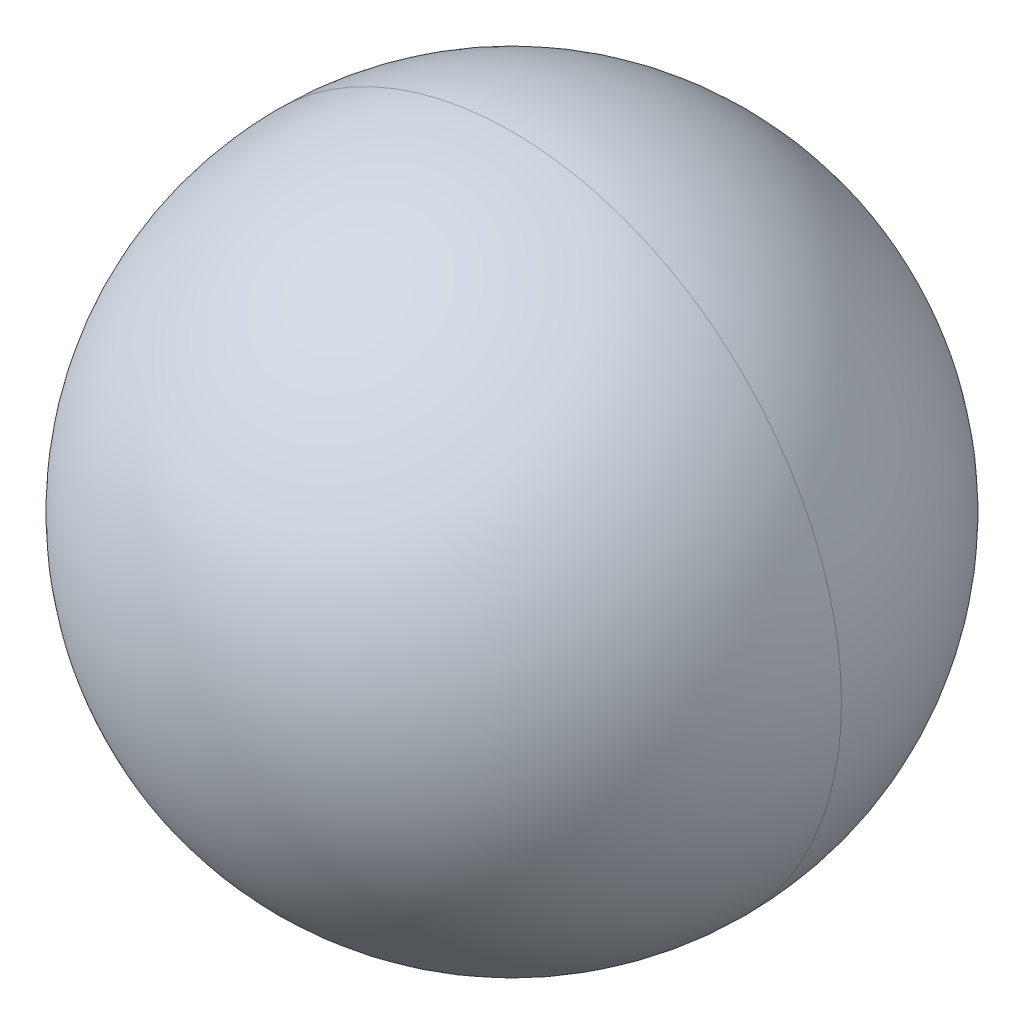
ISO-10303-21;
HEADER;
FILE_DESCRIPTION(('STEP AP214'),'2;1');
FILE_NAME('part.step','',(''),(''),'','','');
FILE_SCHEMA(('AUTOMOTIVE_DESIGN { 1 0 10303 214 1 1 1 1 }'));
ENDSEC;
DATA;
#1=APPLICATION_CONTEXT('core data for automotive mechanical design processes');
#2=APPLICATION_PROTOCOL_DEFINITION('international standard','automotive_design',2000,#1);
#3=PRODUCT_CONTEXT('',#1,'mechanical');
#4=PRODUCT('Part','Part','',(#3));
#5=PRODUCT_RELATED_PRODUCT_CATEGORY('part','',(#4));
#6=PRODUCT_DEFINITION_FORMATION('','',#4);
#7=PRODUCT_DEFINITION_CONTEXT('part definition',#1,'design');
#8=PRODUCT_DEFINITION('design','',#6,#7);
#9=PRODUCT_DEFINITION_SHAPE('','',#8);
#10=(LENGTH_UNIT() NAMED_UNIT(*) SI_UNIT(.MILLI.,.METRE.));
#11=(NAMED_UNIT(*) PLANE_ANGLE_UNIT() SI_UNIT($,.RADIAN.));
#12=(NAMED_UNIT(*) SI_UNIT($,.STERADIAN.) SOLID_ANGLE_UNIT());
#13=UNCERTAINTY_MEASURE_WITH_UNIT(LENGTH_MEASURE(1.E-05),#10,'distance_accuracy_value','');
#14=(GEOMETRIC_REPRESENTATION_CONTEXT(3) GLOBAL_UNCERTAINTY_ASSIGNED_CONTEXT((#13)) GLOBAL_UNIT_ASSIGNED_CONTEXT((#10,
#11,#12)) REPRESENTATION_CONTEXT('',''));
#15=CARTESIAN_POINT('',(0.,0.,0.));
#16=DIRECTION('',(0.,0.,1.));
#17=DIRECTION('',(1.,0.,0.));
#18=AXIS2_PLACEMENT_3D('',#15,#16,#17);
#19=CARTESIAN_POINT('',(-0.2,0.2,0.135));
#20=DIRECTION('',(0.,0.,-1.));
#21=DIRECTION('',(1.,0.,0.));
#22=AXIS2_PLACEMENT_3D('',#19,#20,#21);
#23=SPHERICAL_SURFACE('',#22,0.135);
#24=CARTESIAN_POINT('',(-0.2,0.2,0.135));
#25=DIRECTION('',(0.,0.,1.));
#26=DIRECTION('',(1.,0.,0.));
#27=AXIS2_PLACEMENT_3D('',#24,#25,#26);
#28=CIRCLE('',#27,0.135);
#29=CARTESIAN_POINT('',(-0.065,0.2,0.135));
#30=VERTEX_POINT('',#29);
#31=CARTESIAN_POINT('',(-0.2,0.335,0.135));
#32=VERTEX_POINT('',#31);
#33=EDGE_CURVE('E11',#30,#32,#28,.T.);
#34=ORIENTED_EDGE('',*,*,#33,.F.);
#35=CARTESIAN_POINT('',(-0.065,0.2,0.135));
#36=CARTESIAN_POINT('',(-0.0649999999999998,0.2,0.0925884991765377));
#37=CARTESIAN_POINT('',(-0.0816070255461748,0.2,0.0501374281460087));
#38=CARTESIAN_POINT('',(-0.115137428146008,0.2,0.0166070255461743));
#39=CARTESIAN_POINT('',(-0.157588499176538,0.2,0.));
#40=CARTESIAN_POINT('',(-0.2,0.2,0.));
#41=B_SPLINE_CURVE_WITH_KNOTS('',5,(#35,#36,#37,#38,#39,#40),.UNSPECIFIED.,.F.,.F.,(6,6),(0.,
1.5707963267949),.UNSPECIFIED.);
#42=CARTESIAN_POINT('',(-0.2,0.2,0.));
#43=VERTEX_POINT('',#42);
#44=EDGE_CURVE('E24',#30,#43,#41,.T.);
#45=ORIENTED_EDGE('',*,*,#44,.T.);
#46=ORIENTED_EDGE('',*,*,#44,.F.);
#47=CARTESIAN_POINT('',(-0.2,0.065,0.135));
#48=VERTEX_POINT('',#47);
#49=EDGE_CURVE('E25',#48,#30,#28,.T.);
#50=ORIENTED_EDGE('',*,*,#49,.F.);
#51=CARTESIAN_POINT('',(-0.2,0.2,0.135));
#52=DIRECTION('',(0.,0.,-1.));
#53=DIRECTION('',(-1.,0.,0.));
#54=AXIS2_PLACEMENT_3D('',#51,#52,#53);
#55=CIRCLE('',#54,0.135);
#56=EDGE_CURVE('E46',#48,#32,#55,.T.);
#57=ORIENTED_EDGE('',*,*,#56,.T.);
#58=EDGE_LOOP('',(#34,#45,#46,#50,#57));
#59=FACE_BOUND('',#58,.T.);
#60=ADVANCED_FACE('F17',(#59),#23,.T.);
#61=CARTESIAN_POINT('',(-0.2,0.2,0.135));
#62=DIRECTION('',(0.,0.,-1.));
#63=DIRECTION('',(1.,0.,0.));
#64=AXIS2_PLACEMENT_3D('',#61,#62,#63);
#65=SPHERICAL_SURFACE('',#64,0.135);
#66=ORIENTED_EDGE('',*,*,#56,.F.);
#67=ORIENTED_EDGE('',*,*,#49,.T.);
#68=CARTESIAN_POINT('',(-0.2,0.2,0.27));
#69=CARTESIAN_POINT('',(-0.157588499176538,0.2,0.270000000000001));
#70=CARTESIAN_POINT('',(-0.115137428146008,0.2,0.253392974453824));
#71=CARTESIAN_POINT('',(-0.0816070255461746,0.200000000000001,0.219862571853992));
#72=CARTESIAN_POINT('',(-0.0649999999999999,0.2,0.177411500823462));
#73=CARTESIAN_POINT('',(-0.065,0.2,0.135));
#74=B_SPLINE_CURVE_WITH_KNOTS('',5,(#68,#69,#70,#71,#72,#73),.UNSPECIFIED.,.F.,.F.,(6,6),
(-1.5707963267949,0.),.UNSPECIFIED.);
#75=CARTESIAN_POINT('',(-0.2,0.2,0.27));
#76=VERTEX_POINT('',#75);
#77=EDGE_CURVE('E44',#76,#30,#74,.T.);
#78=ORIENTED_EDGE('',*,*,#77,.F.);
#79=ORIENTED_EDGE('',*,*,#77,.T.);
#80=ORIENTED_EDGE('',*,*,#33,.T.);
#81=EDGE_LOOP('',(#66,#67,#78,#79,#80));
#82=FACE_BOUND('',#81,.T.);
#83=ADVANCED_FACE('F45',(#82),#65,.T.);
#84=CLOSED_SHELL('',(#60,#83));
#85=MANIFOLD_SOLID_BREP('B1',#84);
#86=ADVANCED_BREP_SHAPE_REPRESENTATION('',(#18,#85),#14);
#87=SHAPE_DEFINITION_REPRESENTATION(#9,#86);
ENDSEC;
END-ISO-10303-21;
